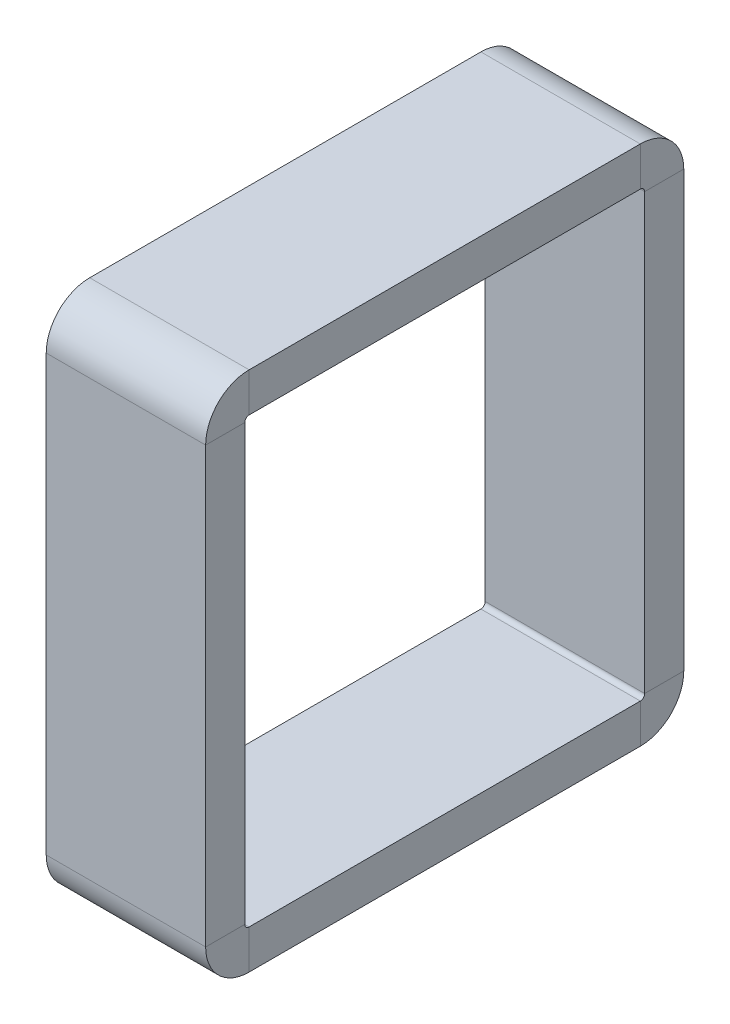
ISO-10303-21;
HEADER;
FILE_DESCRIPTION(('STEP AP214'),'2;1');
FILE_NAME('part.step','',(''),(''),'','','');
FILE_SCHEMA(('AUTOMOTIVE_DESIGN { 1 0 10303 214 1 1 1 1 }'));
ENDSEC;
DATA;
#1=APPLICATION_CONTEXT('core data for automotive mechanical design processes');
#2=APPLICATION_PROTOCOL_DEFINITION('international standard','automotive_design',2000,#1);
#3=PRODUCT_CONTEXT('',#1,'mechanical');
#4=PRODUCT('Part','Part','',(#3));
#5=PRODUCT_RELATED_PRODUCT_CATEGORY('part','',(#4));
#6=PRODUCT_DEFINITION_FORMATION('','',#4);
#7=PRODUCT_DEFINITION_CONTEXT('part definition',#1,'design');
#8=PRODUCT_DEFINITION('design','',#6,#7);
#9=PRODUCT_DEFINITION_SHAPE('','',#8);
#10=(LENGTH_UNIT() NAMED_UNIT(*) SI_UNIT(.MILLI.,.METRE.));
#11=(NAMED_UNIT(*) PLANE_ANGLE_UNIT() SI_UNIT($,.RADIAN.));
#12=(NAMED_UNIT(*) SI_UNIT($,.STERADIAN.) SOLID_ANGLE_UNIT());
#13=UNCERTAINTY_MEASURE_WITH_UNIT(LENGTH_MEASURE(1.E-05),#10,'distance_accuracy_value','');
#14=(GEOMETRIC_REPRESENTATION_CONTEXT(3) GLOBAL_UNCERTAINTY_ASSIGNED_CONTEXT((#13)) GLOBAL_UNIT_ASSIGNED_CONTEXT((#10,
#11,#12)) REPRESENTATION_CONTEXT('',''));
#15=CARTESIAN_POINT('',(0.,0.,0.));
#16=DIRECTION('',(0.,0.,1.));
#17=DIRECTION('',(1.,0.,0.));
#18=AXIS2_PLACEMENT_3D('',#15,#16,#17);
#19=CARTESIAN_POINT('',(-3.71677795736337,-0.75499913114187,-3.24612145499093));
#20=DIRECTION('',(1.,-1.74845553146952E-07,0.));
#21=DIRECTION('',(0.,-8.74227765734758E-08,-1.));
#22=AXIS2_PLACEMENT_3D('',#19,#20,#21);
#23=PLANE('',#22);
#24=CARTESIAN_POINT('',(-3.71677795648915,-0.74999913157898,-3.25112145542804));
#25=DIRECTION('',(-0.999999999999985,1.74845553146949E-07,0.));
#26=DIRECTION('',(1.74845553146949E-07,0.999999999999981,-8.74265104755874E-08));
#27=AXIS2_PLACEMENT_3D('',#24,#25,#26);
#28=CIRCLE('',#27,0.00999999999999571);
#29=CARTESIAN_POINT('',(-3.71677795474069,-0.739999131578984,-3.25112145630227));
#30=VERTEX_POINT('',#29);
#31=CARTESIAN_POINT('',(-3.71677795648915,-0.749999132454212,-3.26112145542804));
#32=VERTEX_POINT('',#31);
#33=EDGE_CURVE('E11',#30,#32,#28,.T.);
#34=ORIENTED_EDGE('',*,*,#33,.F.);
#35=DIRECTION('',(-1.74845555319994E-07,-0.999999999999981,8.74227702585101E-08));
#36=VECTOR('',#35,1.);
#37=CARTESIAN_POINT('',(-3.71677793900459,-0.649999131579984,-3.25112146417132));
#38=LINE('',#37,#36);
#39=CARTESIAN_POINT('',(-3.71677793900459,-0.649999131579984,-3.25112146417032));
#40=VERTEX_POINT('',#39);
#41=EDGE_CURVE('E295',#40,#30,#38,.T.);
#42=ORIENTED_EDGE('',*,*,#41,.F.);
#43=CARTESIAN_POINT('',(-3.71677795648915,-0.749999131579652,-3.25112145542837));
#44=DIRECTION('',(0.999999999999985,-1.74845553146949E-07,0.));
#45=DIRECTION('',(0.,-8.74165517753127E-08,-0.999999999999996));
#46=AXIS2_PLACEMENT_3D('',#43,#44,#45);
#47=CIRCLE('',#46,0.0999999999996649);
#48=CARTESIAN_POINT('',(-3.71677795648915,-0.749999140322262,-3.35112145542804));
#49=VERTEX_POINT('',#48);
#50=EDGE_CURVE('E292',#49,#40,#47,.T.);
#51=ORIENTED_EDGE('',*,*,#50,.F.);
#52=DIRECTION('',(0.,-8.74227727247025E-08,-0.999999999999996));
#53=VECTOR('',#52,1.);
#54=CARTESIAN_POINT('',(-3.71677795648915,-0.749999132453212,-3.26112145542804));
#55=LINE('',#54,#53);
#56=EDGE_CURVE('E281',#32,#49,#55,.T.);
#57=ORIENTED_EDGE('',*,*,#56,.F.);
#58=EDGE_LOOP('',(#34,#42,#51,#57));
#59=FACE_BOUND('',#58,.T.);
#60=ADVANCED_FACE('F17',(#59),#23,.F.);
#61=CARTESIAN_POINT('',(-3.35000013200837,-0.754999195271342,-3.24612145499092));
#62=DIRECTION('',(1.,-1.74845553146952E-07,0.));
#63=DIRECTION('',(0.,-8.74227765734758E-08,-1.));
#64=AXIS2_PLACEMENT_3D('',#61,#62,#63);
#65=PLANE('',#64);
#66=DIRECTION('',(0.,-8.74227764254459E-08,-0.999999999999996));
#67=VECTOR('',#66,1.);
#68=CARTESIAN_POINT('',(-3.35000013113415,-0.749999196582683,-3.26112145542804));
#69=LINE('',#68,#67);
#70=CARTESIAN_POINT('',(-3.35000013113415,-0.749999196583683,-3.26112145542804));
#71=VERTEX_POINT('',#70);
#72=CARTESIAN_POINT('',(-3.35000013113415,-0.749999204451733,-3.35112145542804));
#73=VERTEX_POINT('',#72);
#74=EDGE_CURVE('E24',#71,#73,#69,.T.);
#75=ORIENTED_EDGE('',*,*,#74,.T.);
#76=CARTESIAN_POINT('',(-3.35000013113415,-0.749999195709119,-3.25112145542837));
#77=DIRECTION('',(0.999999999999985,-1.74845553146949E-07,0.));
#78=DIRECTION('',(0.,-8.74161421030166E-08,-0.999999999999996));
#79=AXIS2_PLACEMENT_3D('',#76,#77,#78);
#80=CIRCLE('',#79,0.0999999999996649);
#81=CARTESIAN_POINT('',(-3.35000011364959,-0.649999195708455,-3.25112146417031));
#82=VERTEX_POINT('',#81);
#83=EDGE_CURVE('E290',#73,#82,#80,.T.);
#84=ORIENTED_EDGE('',*,*,#83,.T.);
#85=DIRECTION('',(1.74845555319994E-07,0.999999999999981,-8.74227702585101E-08));
#86=VECTOR('',#85,1.);
#87=CARTESIAN_POINT('',(-3.35000012938569,-0.739999195708455,-3.25112145630326));
#88=LINE('',#87,#86);
#89=CARTESIAN_POINT('',(-3.35000012938569,-0.739999195708455,-3.25112145630226));
#90=VERTEX_POINT('',#89);
#91=EDGE_CURVE('E284',#90,#82,#88,.T.);
#92=ORIENTED_EDGE('',*,*,#91,.F.);
#93=CARTESIAN_POINT('',(-3.35000013113415,-0.749999195708407,-3.25112145542809));
#94=DIRECTION('',(-0.999999999999985,1.74845553146949E-07,0.));
#95=DIRECTION('',(1.74845553146949E-07,0.999999999999981,-8.74179395538373E-08));
#96=AXIS2_PLACEMENT_3D('',#93,#94,#95);
#97=CIRCLE('',#96,0.00999999999999571);
#98=EDGE_CURVE('E274',#90,#71,#97,.T.);
#99=ORIENTED_EDGE('',*,*,#98,.T.);
#100=EDGE_LOOP('',(#75,#84,#92,#99));
#101=FACE_BOUND('',#100,.T.);
#102=ADVANCED_FACE('F409',(#101),#65,.T.);
#103=CARTESIAN_POINT('',(-3.71677795648914,-0.749999131579652,-3.25112145542837));
#104=DIRECTION('',(1.,-1.74845540855598E-07,0.));
#105=DIRECTION('',(-1.74845540855597E-07,-1.,8.74227765734759E-08));
#106=AXIS2_PLACEMENT_3D('',#103,#104,#105);
#107=CYLINDRICAL_SURFACE('',#106,0.0999999999996679);
#108=ORIENTED_EDGE('',*,*,#50,.T.);
#109=DIRECTION('',(-0.999999999999985,1.74845553083486E-07,0.));
#110=VECTOR('',#109,1.);
#111=CARTESIAN_POINT('',(-3.35000011364959,-0.649999195709456,-3.25112146417131));
#112=LINE('',#111,#110);
#113=EDGE_CURVE('E287',#82,#40,#112,.T.);
#114=ORIENTED_EDGE('',*,*,#113,.F.);
#115=ORIENTED_EDGE('',*,*,#83,.F.);
#116=DIRECTION('',(0.999999999999985,-1.74845553083486E-07,0.));
#117=VECTOR('',#116,1.);
#118=CARTESIAN_POINT('',(-3.71677795648915,-0.749999140321261,-3.35112145542804));
#119=LINE('',#118,#117);
#120=EDGE_CURVE('E268',#49,#73,#119,.T.);
#121=ORIENTED_EDGE('',*,*,#120,.F.);
#122=EDGE_LOOP('',(#108,#114,#115,#121));
#123=FACE_BOUND('',#122,.T.);
#124=ADVANCED_FACE('F345',(#123),#107,.T.);
#125=CARTESIAN_POINT('',(-3.71677795648914,-0.74999913157898,-3.25112145542804));
#126=DIRECTION('',(-1.,1.74845430233419E-07,1.1527081280392E-13));
#127=DIRECTION('',(-1.74845430233408E-07,-1.,8.74227765734759E-08));
#128=AXIS2_PLACEMENT_3D('',#125,#126,#127);
#129=CYLINDRICAL_SURFACE('',#128,0.00999999999999601);
#130=ORIENTED_EDGE('',*,*,#33,.T.);
#131=DIRECTION('',(0.999999999999985,-1.74844189739206E-07,0.));
#132=VECTOR('',#131,1.);
#133=CARTESIAN_POINT('',(-3.71677795648915,-0.749999132453461,-3.26112145542804));
#134=LINE('',#133,#132);
#135=EDGE_CURVE('E276',#32,#71,#134,.T.);
#136=ORIENTED_EDGE('',*,*,#135,.T.);
#137=ORIENTED_EDGE('',*,*,#98,.F.);
#138=DIRECTION('',(0.999999999999985,-1.74845553083486E-07,0.));
#139=VECTOR('',#138,1.);
#140=CARTESIAN_POINT('',(-3.71677795474069,-0.739999131578984,-3.25112145630327));
#141=LINE('',#140,#139);
#142=EDGE_CURVE('E262',#30,#90,#141,.T.);
#143=ORIENTED_EDGE('',*,*,#142,.F.);
#144=EDGE_LOOP('',(#130,#136,#137,#143));
#145=FACE_BOUND('',#144,.T.);
#146=ADVANCED_FACE('F304',(#145),#129,.F.);
#147=CARTESIAN_POINT('',(-3.71677793900458,-0.649999052899485,-2.35112146417132));
#148=DIRECTION('',(1.,-1.74845553146952E-07,0.));
#149=DIRECTION('',(-1.74845553146952E-07,-1.,8.74227765734759E-08));
#150=AXIS2_PLACEMENT_3D('',#147,#148,#149);
#151=PLANE('',#150);
#152=DIRECTION('',(0.,-8.7422776548804E-08,-0.999999999999996));
#153=VECTOR('',#152,1.);
#154=CARTESIAN_POINT('',(-3.71677793900458,-0.649999052899485,-2.35112146417132));
#155=LINE('',#154,#153);
#156=CARTESIAN_POINT('',(-3.71677793900358,-0.649999052902485,-2.35112146416832));
#157=VERTEX_POINT('',#156);
#158=EDGE_CURVE('E278',#157,#40,#155,.T.);
#159=ORIENTED_EDGE('',*,*,#158,.T.);
#160=ORIENTED_EDGE('',*,*,#41,.T.);
#161=DIRECTION('',(0.,-8.74227765488039E-08,-0.999999999999996));
#162=VECTOR('',#161,1.);
#163=CARTESIAN_POINT('',(-3.71677795474068,-0.739999052898485,-2.35112145630327));
#164=LINE('',#163,#162);
#165=CARTESIAN_POINT('',(-3.71677795473968,-0.739999052901485,-2.35112145630027));
#166=VERTEX_POINT('',#165);
#167=EDGE_CURVE('E265',#166,#30,#164,.T.);
#168=ORIENTED_EDGE('',*,*,#167,.F.);
#169=DIRECTION('',(-1.74845550387524E-07,-0.999999999999981,8.74333839915533E-08));
#170=VECTOR('',#169,1.);
#171=CARTESIAN_POINT('',(-3.71677793900358,-0.64999905290044,-2.35112146417227));
#172=LINE('',#171,#170);
#173=EDGE_CURVE('E147',#157,#166,#172,.T.);
#174=ORIENTED_EDGE('',*,*,#173,.F.);
#175=EDGE_LOOP('',(#159,#160,#168,#174));
#176=FACE_BOUND('',#175,.T.);
#177=ADVANCED_FACE('F297',(#176),#151,.F.);
#178=CARTESIAN_POINT('',(-3.35000011364958,-0.649999117028957,-2.35112146417131));
#179=DIRECTION('',(-1.74845553146952E-07,-1.,8.74227765734759E-08));
#180=DIRECTION('',(-1.,1.74845553146952E-07,0.));
#181=AXIS2_PLACEMENT_3D('',#178,#179,#180);
#182=PLANE('',#181);
#183=DIRECTION('',(0.,-8.7422776548804E-08,-0.999999999999996));
#184=VECTOR('',#183,1.);
#185=CARTESIAN_POINT('',(-3.35000011364958,-0.649999117028957,-2.35112146417131));
#186=LINE('',#185,#184);
#187=CARTESIAN_POINT('',(-3.35000011365058,-0.649999117031957,-2.35112146416831));
#188=VERTEX_POINT('',#187);
#189=EDGE_CURVE('E271',#188,#82,#186,.T.);
#190=ORIENTED_EDGE('',*,*,#189,.T.);
#191=ORIENTED_EDGE('',*,*,#113,.T.);
#192=ORIENTED_EDGE('',*,*,#158,.F.);
#193=DIRECTION('',(-0.999999999999985,1.74845553083486E-07,0.));
#194=VECTOR('',#193,1.);
#195=CARTESIAN_POINT('',(-3.35000011364958,-0.649999117028957,-2.35112146417131));
#196=LINE('',#195,#194);
#197=EDGE_CURVE('E255',#188,#157,#196,.T.);
#198=ORIENTED_EDGE('',*,*,#197,.F.);
#199=EDGE_LOOP('',(#190,#191,#192,#198));
#200=FACE_BOUND('',#199,.T.);
#201=ADVANCED_FACE('F342',(#200),#182,.F.);
#202=CARTESIAN_POINT('',(-3.71677795474068,-0.739999052898485,-2.35112145630327));
#203=DIRECTION('',(1.74845553146952E-07,1.,-8.74227765734759E-08));
#204=DIRECTION('',(1.,-1.74845553146952E-07,0.));
#205=AXIS2_PLACEMENT_3D('',#202,#203,#204);
#206=PLANE('',#205);
#207=ORIENTED_EDGE('',*,*,#167,.T.);
#208=ORIENTED_EDGE('',*,*,#142,.T.);
#209=DIRECTION('',(0.,-8.74227765488039E-08,-0.999999999999996));
#210=VECTOR('',#209,1.);
#211=CARTESIAN_POINT('',(-3.35000012938568,-0.739999117027957,-2.35112145630326));
#212=LINE('',#211,#210);
#213=CARTESIAN_POINT('',(-3.35000012938668,-0.739999117030957,-2.35112145630026));
#214=VERTEX_POINT('',#213);
#215=EDGE_CURVE('E259',#214,#90,#212,.T.);
#216=ORIENTED_EDGE('',*,*,#215,.F.);
#217=DIRECTION('',(0.999999999999985,-1.74845553083486E-07,0.));
#218=VECTOR('',#217,1.);
#219=CARTESIAN_POINT('',(-3.71677795474068,-0.739999052898485,-2.35112145630327));
#220=LINE('',#219,#218);
#221=EDGE_CURVE('E251',#166,#214,#220,.T.);
#222=ORIENTED_EDGE('',*,*,#221,.F.);
#223=EDGE_LOOP('',(#207,#208,#216,#222));
#224=FACE_BOUND('',#223,.T.);
#225=ADVANCED_FACE('F301',(#224),#206,.F.);
#226=CARTESIAN_POINT('',(-3.35000012938568,-0.739999117027957,-2.35112145630326));
#227=DIRECTION('',(-1.,1.74845553146952E-07,0.));
#228=DIRECTION('',(1.74845553146952E-07,1.,-8.74227765734759E-08));
#229=AXIS2_PLACEMENT_3D('',#226,#227,#228);
#230=PLANE('',#229);
#231=ORIENTED_EDGE('',*,*,#215,.T.);
#232=ORIENTED_EDGE('',*,*,#91,.T.);
#233=ORIENTED_EDGE('',*,*,#189,.F.);
#234=DIRECTION('',(1.7484555038515E-07,0.999999999999981,-8.74223508406634E-08));
#235=VECTOR('',#234,1.);
#236=CARTESIAN_POINT('',(-3.35000012938668,-0.739999117028224,-2.3511214563033));
#237=LINE('',#236,#235);
#238=EDGE_CURVE('E242',#214,#188,#237,.T.);
#239=ORIENTED_EDGE('',*,*,#238,.F.);
#240=EDGE_LOOP('',(#231,#232,#233,#239));
#241=FACE_BOUND('',#240,.T.);
#242=ADVANCED_FACE('F308',(#241),#230,.F.);
#243=CARTESIAN_POINT('',(-3.71677814007698,-1.7999991446924,-3.40112136363512));
#244=DIRECTION('',(-1.,1.74845553146952E-07,0.));
#245=DIRECTION('',(0.,8.74227765734759E-08,1.));
#246=AXIS2_PLACEMENT_3D('',#243,#244,#245);
#247=PLANE('',#246);
#248=ORIENTED_EDGE('',*,*,#56,.T.);
#249=DIRECTION('',(-1.74845553146948E-07,-0.999999999999981,8.7420776395673E-08));
#250=VECTOR('',#249,1.);
#251=CARTESIAN_POINT('',(-3.71677795648915,-0.749999140321262,-3.35112145542804));
#252=LINE('',#251,#250);
#253=CARTESIAN_POINT('',(-3.7167781313347,-1.74999914032026,-3.35112136800626));
#254=VERTEX_POINT('',#253);
#255=EDGE_CURVE('E253',#49,#254,#252,.T.);
#256=ORIENTED_EDGE('',*,*,#255,.T.);
#257=DIRECTION('',(0.,8.74116680263222E-08,0.999999999999996));
#258=VECTOR('',#257,1.);
#259=CARTESIAN_POINT('',(-3.7167781313347,-1.74999914032126,-3.35112136800726));
#260=LINE('',#259,#258);
#261=CARTESIAN_POINT('',(-3.7167781313337,-1.74999913245321,-3.26112136800626));
#262=VERTEX_POINT('',#261);
#263=EDGE_CURVE('E245',#254,#262,#260,.T.);
#264=ORIENTED_EDGE('',*,*,#263,.T.);
#265=DIRECTION('',(1.74845553146774E-07,0.999999999999981,-8.74217769285754E-08));
#266=VECTOR('',#265,1.);
#267=CARTESIAN_POINT('',(-3.7167781313347,-1.74999913245421,-3.26112136800626));
#268=LINE('',#267,#266);
#269=EDGE_CURVE('E233',#262,#32,#268,.T.);
#270=ORIENTED_EDGE('',*,*,#269,.T.);
#271=EDGE_LOOP('',(#248,#256,#264,#270));
#272=FACE_BOUND('',#271,.T.);
#273=ADVANCED_FACE('F350',(#272),#247,.T.);
#274=CARTESIAN_POINT('',(-3.71677795648915,-0.749999140321261,-3.35112145542804));
#275=DIRECTION('',(0.,8.74207763956747E-08,1.));
#276=DIRECTION('',(-1.74845553146952E-07,-1.,8.74207763956747E-08));
#277=AXIS2_PLACEMENT_3D('',#274,#275,#276);
#278=PLANE('',#277);
#279=ORIENTED_EDGE('',*,*,#120,.T.);
#280=DIRECTION('',(-1.74845553146948E-07,-0.999999999999981,8.7420776395673E-08));
#281=VECTOR('',#280,1.);
#282=CARTESIAN_POINT('',(-3.35000013113415,-0.749999204450733,-3.35112145542804));
#283=LINE('',#282,#281);
#284=CARTESIAN_POINT('',(-3.3500003059807,-1.74999920444973,-3.35112136800626));
#285=VERTEX_POINT('',#284);
#286=EDGE_CURVE('E247',#73,#285,#283,.T.);
#287=ORIENTED_EDGE('',*,*,#286,.T.);
#288=DIRECTION('',(0.999999999999985,-1.74845553083486E-07,0.));
#289=VECTOR('',#288,1.);
#290=CARTESIAN_POINT('',(-3.7167781313347,-1.74999914032126,-3.35112136800726));
#291=LINE('',#290,#289);
#292=EDGE_CURVE('E236',#254,#285,#291,.T.);
#293=ORIENTED_EDGE('',*,*,#292,.F.);
#294=ORIENTED_EDGE('',*,*,#255,.F.);
#295=EDGE_LOOP('',(#279,#287,#293,#294));
#296=FACE_BOUND('',#295,.T.);
#297=ADVANCED_FACE('F364',(#296),#278,.F.);
#298=CARTESIAN_POINT('',(-3.7167781313347,-1.74999913245421,-3.26112136800626));
#299=DIRECTION('',(0.,-8.74217769286645E-08,-1.));
#300=DIRECTION('',(1.74845553146952E-07,1.,-8.74217769286645E-08));
#301=AXIS2_PLACEMENT_3D('',#298,#299,#300);
#302=PLANE('',#301);
#303=DIRECTION('',(0.999999999999985,-1.74844189739206E-07,0.));
#304=VECTOR('',#303,1.);
#305=CARTESIAN_POINT('',(-3.7167781313347,-1.74999913245396,-3.26112136800626));
#306=LINE('',#305,#304);
#307=CARTESIAN_POINT('',(-3.3500003059807,-1.74999919658168,-3.26112136800626));
#308=VERTEX_POINT('',#307);
#309=EDGE_CURVE('E249',#262,#308,#306,.T.);
#310=ORIENTED_EDGE('',*,*,#309,.T.);
#311=DIRECTION('',(1.74845553146861E-07,0.999999999999981,-8.74217769286191E-08));
#312=VECTOR('',#311,1.);
#313=CARTESIAN_POINT('',(-3.3500003059797,-1.74999919658293,-3.26112136800626));
#314=LINE('',#313,#312);
#315=EDGE_CURVE('E239',#308,#71,#314,.T.);
#316=ORIENTED_EDGE('',*,*,#315,.T.);
#317=ORIENTED_EDGE('',*,*,#135,.F.);
#318=ORIENTED_EDGE('',*,*,#269,.F.);
#319=EDGE_LOOP('',(#310,#316,#317,#318));
#320=FACE_BOUND('',#319,.T.);
#321=ADVANCED_FACE('F355',(#320),#302,.F.);
#322=CARTESIAN_POINT('',(-3.35000031472198,-1.79999920882187,-3.40112136363512));
#323=DIRECTION('',(-1.,1.74845553146952E-07,0.));
#324=DIRECTION('',(0.,8.74227765734759E-08,1.));
#325=AXIS2_PLACEMENT_3D('',#322,#323,#324);
#326=PLANE('',#325);
#327=ORIENTED_EDGE('',*,*,#315,.F.);
#328=DIRECTION('',(0.,8.74121639268677E-08,0.999999999999996));
#329=VECTOR('',#328,1.);
#330=CARTESIAN_POINT('',(-3.3500003059797,-1.74999920444978,-3.3511213680063));
#331=LINE('',#330,#329);
#332=EDGE_CURVE('E228',#285,#308,#331,.T.);
#333=ORIENTED_EDGE('',*,*,#332,.F.);
#334=ORIENTED_EDGE('',*,*,#286,.F.);
#335=ORIENTED_EDGE('',*,*,#74,.F.);
#336=EDGE_LOOP('',(#327,#333,#334,#335));
#337=FACE_BOUND('',#336,.T.);
#338=ADVANCED_FACE('F361',(#337),#326,.F.);
#339=CARTESIAN_POINT('',(-3.71677814969348,-1.85499913114087,-3.24612135882787));
#340=DIRECTION('',(1.,-1.74845553146952E-07,0.));
#341=DIRECTION('',(0.,-8.74227765734759E-08,-1.));
#342=AXIS2_PLACEMENT_3D('',#339,#340,#341);
#343=PLANE('',#342);
#344=CARTESIAN_POINT('',(-3.7167781313347,-1.74999913157899,-3.25112136800627));
#345=DIRECTION('',(-0.999999999999985,1.74845553146949E-07,0.));
#346=DIRECTION('',(0.,-8.7420604089077E-08,-0.999999999999996));
#347=AXIS2_PLACEMENT_3D('',#344,#345,#346);
#348=CIRCLE('',#347,0.0099999999999977);
#349=CARTESIAN_POINT('',(-3.71677813308215,-1.75999913157898,-3.25112136713204));
#350=VERTEX_POINT('',#349);
#351=EDGE_CURVE('E231',#262,#350,#348,.T.);
#352=ORIENTED_EDGE('',*,*,#351,.F.);
#353=ORIENTED_EDGE('',*,*,#263,.F.);
#354=CARTESIAN_POINT('',(-3.7167781313347,-1.74999913157919,-3.25112136800747));
#355=DIRECTION('',(0.999999999999985,-1.74845553146949E-07,0.));
#356=DIRECTION('',(-1.74845553146949E-07,-0.999999999999981,8.74250316595358E-08));
#357=AXIS2_PLACEMENT_3D('',#354,#355,#356);
#358=CIRCLE('',#357,0.099999999998794);
#359=CARTESIAN_POINT('',(-3.71677814881825,-1.84999913157798,-3.25112135926399));
#360=VERTEX_POINT('',#359);
#361=EDGE_CURVE('E225',#360,#254,#358,.T.);
#362=ORIENTED_EDGE('',*,*,#361,.F.);
#363=DIRECTION('',(-1.74845555319994E-07,-0.999999999999981,8.74116680282638E-08));
#364=VECTOR('',#363,1.);
#365=CARTESIAN_POINT('',(-3.71677813308315,-1.75999913157898,-3.25112136713204));
#366=LINE('',#365,#364);
#367=EDGE_CURVE('E215',#350,#360,#366,.T.);
#368=ORIENTED_EDGE('',*,*,#367,.F.);
#369=EDGE_LOOP('',(#352,#353,#362,#368));
#370=FACE_BOUND('',#369,.T.);
#371=ADVANCED_FACE('F372',(#370),#343,.F.);
#372=CARTESIAN_POINT('',(-3.7167781313347,-1.74999913157919,-3.25112136800747));
#373=DIRECTION('',(1.,-1.74845565438307E-07,0.));
#374=DIRECTION('',(-1.74845565438306E-07,-1.,8.74227765734759E-08));
#375=AXIS2_PLACEMENT_3D('',#372,#373,#374);
#376=CYLINDRICAL_SURFACE('',#375,0.0999999999987971);
#377=ORIENTED_EDGE('',*,*,#361,.T.);
#378=ORIENTED_EDGE('',*,*,#292,.T.);
#379=CARTESIAN_POINT('',(-3.3500003059797,-1.74999919570866,-3.25112136800747));
#380=DIRECTION('',(0.999999999999985,-1.74845553146949E-07,0.));
#381=DIRECTION('',(-1.74845553146949E-07,-0.999999999999981,8.7425084950241E-08));
#382=AXIS2_PLACEMENT_3D('',#379,#380,#381);
#383=CIRCLE('',#382,0.099999999998794);
#384=CARTESIAN_POINT('',(-3.35000032346525,-1.84999919570746,-3.25112135926398));
#385=VERTEX_POINT('',#384);
#386=EDGE_CURVE('E218',#385,#285,#383,.T.);
#387=ORIENTED_EDGE('',*,*,#386,.F.);
#388=DIRECTION('',(0.999999999999985,-1.74845553083486E-07,0.));
#389=VECTOR('',#388,1.);
#390=CARTESIAN_POINT('',(-3.71677814881925,-1.84999913157798,-3.25112135926499));
#391=LINE('',#390,#389);
#392=EDGE_CURVE('E209',#360,#385,#391,.T.);
#393=ORIENTED_EDGE('',*,*,#392,.F.);
#394=EDGE_LOOP('',(#377,#378,#387,#393));
#395=FACE_BOUND('',#394,.T.);
#396=ADVANCED_FACE('F368',(#395),#376,.T.);
#397=CARTESIAN_POINT('',(-3.7167781313347,-1.74999913157899,-3.25112136800627));
#398=DIRECTION('',(-1.,1.74845676060506E-07,1.15270791313044E-13));
#399=DIRECTION('',(-1.74845676060496E-07,-1.,8.74227765734759E-08));
#400=AXIS2_PLACEMENT_3D('',#397,#398,#399);
#401=CYLINDRICAL_SURFACE('',#400,0.00999999999999801);
#402=ORIENTED_EDGE('',*,*,#351,.T.);
#403=DIRECTION('',(0.999999999999985,-1.74842826394926E-07,0.));
#404=VECTOR('',#403,1.);
#405=CARTESIAN_POINT('',(-3.71677813308315,-1.75999913157898,-3.25112136713204));
#406=LINE('',#405,#404);
#407=CARTESIAN_POINT('',(-3.35000030772915,-1.75999919570746,-3.25112136713203));
#408=VERTEX_POINT('',#407);
#409=EDGE_CURVE('E221',#350,#408,#406,.T.);
#410=ORIENTED_EDGE('',*,*,#409,.T.);
#411=CARTESIAN_POINT('',(-3.3500003059797,-1.7499991957085,-3.25112136800631));
#412=DIRECTION('',(-0.999999999999985,1.74845553146949E-07,0.));
#413=DIRECTION('',(0.,-8.73160876935426E-08,-0.999999999999996));
#414=AXIS2_PLACEMENT_3D('',#411,#412,#413);
#415=CIRCLE('',#414,0.0099999999999977);
#416=EDGE_CURVE('E212',#308,#408,#415,.T.);
#417=ORIENTED_EDGE('',*,*,#416,.F.);
#418=ORIENTED_EDGE('',*,*,#309,.F.);
#419=EDGE_LOOP('',(#402,#410,#417,#418));
#420=FACE_BOUND('',#419,.T.);
#421=ADVANCED_FACE('F374',(#420),#401,.F.);
#422=CARTESIAN_POINT('',(-3.35000032433848,-1.85499919527034,-3.24612135882787));
#423=DIRECTION('',(1.,-1.74845553146952E-07,0.));
#424=DIRECTION('',(0.,-8.74227765734759E-08,-1.));
#425=AXIS2_PLACEMENT_3D('',#422,#423,#424);
#426=PLANE('',#425);
#427=DIRECTION('',(-1.74845550383717E-07,-0.999999999999981,8.74106564907539E-08));
#428=VECTOR('',#427,1.);
#429=CARTESIAN_POINT('',(-3.35000030772815,-1.75999919570745,-3.25112136713194));
#430=LINE('',#429,#428);
#431=EDGE_CURVE('E223',#408,#385,#430,.T.);
#432=ORIENTED_EDGE('',*,*,#431,.T.);
#433=ORIENTED_EDGE('',*,*,#386,.T.);
#434=ORIENTED_EDGE('',*,*,#332,.T.);
#435=ORIENTED_EDGE('',*,*,#416,.T.);
#436=EDGE_LOOP('',(#432,#433,#434,#435));
#437=FACE_BOUND('',#436,.T.);
#438=ADVANCED_FACE('F377',(#437),#426,.T.);
#439=CARTESIAN_POINT('',(-3.7167781566873,-1.89499913551501,-3.29612135533096));
#440=DIRECTION('',(-1.,1.74845553146952E-07,0.));
#441=DIRECTION('',(0.,8.74227765734759E-08,1.));
#442=AXIS2_PLACEMENT_3D('',#439,#440,#441);
#443=PLANE('',#442);
#444=ORIENTED_EDGE('',*,*,#367,.T.);
#445=DIRECTION('',(0.,8.74194432892096E-08,0.999999999999996));
#446=VECTOR('',#445,1.);
#447=CARTESIAN_POINT('',(-3.71677814881925,-1.84999913157798,-3.25112135926499));
#448=LINE('',#447,#446);
#449=CARTESIAN_POINT('',(-3.71677814881825,-1.84999905290048,-2.35112135926599));
#450=VERTEX_POINT('',#449);
#451=EDGE_CURVE('E207',#360,#450,#448,.T.);
#452=ORIENTED_EDGE('',*,*,#451,.T.);
#453=DIRECTION('',(1.74845555318051E-07,0.999999999999981,-8.74227850605123E-08));
#454=VECTOR('',#453,1.);
#455=CARTESIAN_POINT('',(-3.71677814881925,-1.84999905290048,-2.35112135926499));
#456=LINE('',#455,#454);
#457=CARTESIAN_POINT('',(-3.71677813308215,-1.75999905290048,-2.35112136713304));
#458=VERTEX_POINT('',#457);
#459=EDGE_CURVE('E201',#450,#458,#456,.T.);
#460=ORIENTED_EDGE('',*,*,#459,.T.);
#461=DIRECTION('',(0.,-8.74205547459126E-08,-0.999999999999996));
#462=VECTOR('',#461,1.);
#463=CARTESIAN_POINT('',(-3.71677813308315,-1.75999905290048,-2.35112136713304));
#464=LINE('',#463,#462);
#465=EDGE_CURVE('E192',#458,#350,#464,.T.);
#466=ORIENTED_EDGE('',*,*,#465,.T.);
#467=EDGE_LOOP('',(#444,#452,#460,#466));
#468=FACE_BOUND('',#467,.T.);
#469=ADVANCED_FACE('F397',(#468),#443,.T.);
#470=CARTESIAN_POINT('',(-3.71677814881925,-1.84999913157798,-3.25112135926499));
#471=DIRECTION('',(1.74845553146952E-07,1.,-8.74194431905235E-08));
#472=DIRECTION('',(0.,8.74194431905235E-08,1.));
#473=AXIS2_PLACEMENT_3D('',#470,#471,#472);
#474=PLANE('',#473);
#475=ORIENTED_EDGE('',*,*,#392,.T.);
#476=DIRECTION('',(0.,8.74194432892097E-08,0.999999999999996));
#477=VECTOR('',#476,1.);
#478=CARTESIAN_POINT('',(-3.35000032346425,-1.84999919570746,-3.25112135926498));
#479=LINE('',#478,#477);
#480=CARTESIAN_POINT('',(-3.35000032346525,-1.84999911702996,-2.35112135926598));
#481=VERTEX_POINT('',#480);
#482=EDGE_CURVE('E203',#385,#481,#479,.T.);
#483=ORIENTED_EDGE('',*,*,#482,.T.);
#484=DIRECTION('',(0.999999999999985,-1.74845553083487E-07,0.));
#485=VECTOR('',#484,1.);
#486=CARTESIAN_POINT('',(-3.71677814881925,-1.84999905290048,-2.35112135926499));
#487=LINE('',#486,#485);
#488=EDGE_CURVE('E195',#450,#481,#487,.T.);
#489=ORIENTED_EDGE('',*,*,#488,.F.);
#490=ORIENTED_EDGE('',*,*,#451,.F.);
#491=EDGE_LOOP('',(#475,#483,#489,#490));
#492=FACE_BOUND('',#491,.T.);
#493=ADVANCED_FACE('F381',(#492),#474,.F.);
#494=CARTESIAN_POINT('',(-3.71677813308315,-1.75999905290048,-2.35112136713304));
#495=DIRECTION('',(-1.74842826458391E-07,-1.,8.7420554400413E-08));
#496=DIRECTION('',(0.,-8.7420554400413E-08,-1.));
#497=AXIS2_PLACEMENT_3D('',#494,#495,#496);
#498=PLANE('',#497);
#499=DIRECTION('',(0.999999999999985,-1.74842826394926E-07,0.));
#500=VECTOR('',#499,1.);
#501=CARTESIAN_POINT('',(-3.71677813308315,-1.75999905290048,-2.35112136713304));
#502=LINE('',#501,#500);
#503=CARTESIAN_POINT('',(-3.35000030772915,-1.75999911702996,-2.35112136713303));
#504=VERTEX_POINT('',#503);
#505=EDGE_CURVE('E205',#458,#504,#502,.T.);
#506=ORIENTED_EDGE('',*,*,#505,.T.);
#507=DIRECTION('',(0.,-8.74205544991963E-08,-0.999999999999996));
#508=VECTOR('',#507,1.);
#509=CARTESIAN_POINT('',(-3.35000030772815,-1.75999911702896,-2.35112136713303));
#510=LINE('',#509,#508);
#511=EDGE_CURVE('E198',#504,#408,#510,.T.);
#512=ORIENTED_EDGE('',*,*,#511,.T.);
#513=ORIENTED_EDGE('',*,*,#409,.F.);
#514=ORIENTED_EDGE('',*,*,#465,.F.);
#515=EDGE_LOOP('',(#506,#512,#513,#514));
#516=FACE_BOUND('',#515,.T.);
#517=ADVANCED_FACE('F398',(#516),#498,.F.);
#518=CARTESIAN_POINT('',(-3.35000033133231,-1.89499919964448,-3.29612135533096));
#519=DIRECTION('',(-1.,1.74845553146952E-07,0.));
#520=DIRECTION('',(0.,8.74227765734759E-08,1.));
#521=AXIS2_PLACEMENT_3D('',#518,#519,#520);
#522=PLANE('',#521);
#523=ORIENTED_EDGE('',*,*,#511,.F.);
#524=DIRECTION('',(1.74845550383726E-07,0.999999999999981,-8.74227751918632E-08));
#525=VECTOR('',#524,1.);
#526=CARTESIAN_POINT('',(-3.35000032346525,-1.84999911702996,-2.35112135926498));
#527=LINE('',#526,#525);
#528=EDGE_CURVE('E187',#481,#504,#527,.T.);
#529=ORIENTED_EDGE('',*,*,#528,.F.);
#530=ORIENTED_EDGE('',*,*,#482,.F.);
#531=ORIENTED_EDGE('',*,*,#431,.F.);
#532=EDGE_LOOP('',(#523,#529,#530,#531));
#533=FACE_BOUND('',#532,.T.);
#534=ADVANCED_FACE('F385',(#533),#522,.F.);
#535=CARTESIAN_POINT('',(-3.71677814969247,-1.85499904372109,-2.24612135882887));
#536=DIRECTION('',(1.,-1.74845553146952E-07,0.));
#537=DIRECTION('',(0.,-8.74227765734759E-08,-1.));
#538=AXIS2_PLACEMENT_3D('',#535,#536,#537);
#539=PLANE('',#538);
#540=CARTESIAN_POINT('',(-3.71677813133369,-1.74999905290049,-2.35112136800726));
#541=DIRECTION('',(-0.999999999999985,1.74845553146949E-07,0.));
#542=DIRECTION('',(-1.74845553146949E-07,-0.999999999999981,8.74226024905097E-08));
#543=AXIS2_PLACEMENT_3D('',#540,#541,#542);
#544=CIRCLE('',#543,0.00999999999999926);
#545=CARTESIAN_POINT('',(-3.71677813133369,-1.74999905202526,-2.34112136800726));
#546=VERTEX_POINT('',#545);
#547=EDGE_CURVE('E190',#458,#546,#544,.T.);
#548=ORIENTED_EDGE('',*,*,#547,.F.);
#549=ORIENTED_EDGE('',*,*,#459,.F.);
#550=CARTESIAN_POINT('',(-3.71677813133369,-1.74999905290051,-2.35112136800824));
#551=DIRECTION('',(0.999999999999985,-1.74845553146949E-07,0.));
#552=DIRECTION('',(0.,8.74230199343852E-08,0.999999999999996));
#553=AXIS2_PLACEMENT_3D('',#550,#551,#552);
#554=CIRCLE('',#553,0.0999999999999726);
#555=CARTESIAN_POINT('',(-3.71677813133369,-1.74999904415821,-2.25112136800826));
#556=VERTEX_POINT('',#555);
#557=EDGE_CURVE('E184',#556,#450,#554,.T.);
#558=ORIENTED_EDGE('',*,*,#557,.F.);
#559=DIRECTION('',(0.,8.74111622599545E-08,0.999999999999996));
#560=VECTOR('',#559,1.);
#561=CARTESIAN_POINT('',(-3.71677813133369,-1.74999905202621,-2.34112136800731));
#562=LINE('',#561,#560);
#563=EDGE_CURVE('E176',#546,#556,#562,.T.);
#564=ORIENTED_EDGE('',*,*,#563,.F.);
#565=EDGE_LOOP('',(#548,#549,#558,#564));
#566=FACE_BOUND('',#565,.T.);
#567=ADVANCED_FACE('F395',(#566),#539,.F.);
#568=CARTESIAN_POINT('',(-3.71677813133369,-1.74999905290051,-2.35112136800824));
#569=DIRECTION('',(1.,-1.74845565438305E-07,0.));
#570=DIRECTION('',(-1.74845565438306E-07,-1.,8.74227765734759E-08));
#571=AXIS2_PLACEMENT_3D('',#568,#569,#570);
#572=CYLINDRICAL_SURFACE('',#571,0.0999999999999757);
#573=ORIENTED_EDGE('',*,*,#557,.T.);
#574=ORIENTED_EDGE('',*,*,#488,.T.);
#575=CARTESIAN_POINT('',(-3.35000030598069,-1.74999911702999,-2.35112136800823));
#576=DIRECTION('',(0.999999999999985,-1.74845553146949E-07,0.));
#577=DIRECTION('',(0.,8.74230643433062E-08,0.999999999999996));
#578=AXIS2_PLACEMENT_3D('',#575,#576,#577);
#579=CIRCLE('',#578,0.0999999999999726);
#580=CARTESIAN_POINT('',(-3.35000030598069,-1.74999910828768,-2.25112136800826));
#581=VERTEX_POINT('',#580);
#582=EDGE_CURVE('E178',#581,#481,#579,.T.);
#583=ORIENTED_EDGE('',*,*,#582,.F.);
#584=DIRECTION('',(0.999999999999985,-1.7484418974016E-07,0.));
#585=VECTOR('',#584,1.);
#586=CARTESIAN_POINT('',(-3.71677813133369,-1.74999904415896,-2.25112136800826));
#587=LINE('',#586,#585);
#588=EDGE_CURVE('E167',#556,#581,#587,.T.);
#589=ORIENTED_EDGE('',*,*,#588,.F.);
#590=EDGE_LOOP('',(#573,#574,#583,#589));
#591=FACE_BOUND('',#590,.T.);
#592=ADVANCED_FACE('F335',(#591),#572,.T.);
#593=CARTESIAN_POINT('',(-3.71677813133369,-1.74999905290049,-2.35112136800726));
#594=DIRECTION('',(-1.,1.74845676060485E-07,-1.30556296525245E-13));
#595=DIRECTION('',(-1.74845676060496E-07,-1.,8.74227765734759E-08));
#596=AXIS2_PLACEMENT_3D('',#593,#594,#595);
#597=CYLINDRICAL_SURFACE('',#596,0.00999999999999957);
#598=ORIENTED_EDGE('',*,*,#547,.T.);
#599=DIRECTION('',(0.999999999999985,-1.7484555308444E-07,0.));
#600=VECTOR('',#599,1.);
#601=CARTESIAN_POINT('',(-3.71677813133369,-1.74999905202626,-2.34112136800726));
#602=LINE('',#601,#600);
#603=CARTESIAN_POINT('',(-3.35000030598069,-1.74999911615473,-2.34112136800726));
#604=VERTEX_POINT('',#603);
#605=EDGE_CURVE('E158',#546,#604,#602,.T.);
#606=ORIENTED_EDGE('',*,*,#605,.T.);
#607=CARTESIAN_POINT('',(-3.35000030598069,-1.74999911703,-2.35112136800721));
#608=DIRECTION('',(-0.999999999999985,1.74845553146949E-07,0.));
#609=DIRECTION('',(-1.74845553146949E-07,-0.999999999999981,8.74181171894902E-08));
#610=AXIS2_PLACEMENT_3D('',#607,#608,#609);
#611=CIRCLE('',#610,0.00999999999999926);
#612=EDGE_CURVE('E173',#504,#604,#611,.T.);
#613=ORIENTED_EDGE('',*,*,#612,.F.);
#614=ORIENTED_EDGE('',*,*,#505,.F.);
#615=EDGE_LOOP('',(#598,#606,#613,#614));
#616=FACE_BOUND('',#615,.T.);
#617=ADVANCED_FACE('F389',(#616),#597,.F.);
#618=CARTESIAN_POINT('',(-3.35000032433947,-1.85499910785057,-2.24612135882887));
#619=DIRECTION('',(1.,-1.74845553146952E-07,0.));
#620=DIRECTION('',(0.,-8.74227765734759E-08,-1.));
#621=AXIS2_PLACEMENT_3D('',#618,#619,#620);
#622=PLANE('',#621);
#623=DIRECTION('',(0.,8.74227776599981E-08,0.999999999999996));
#624=VECTOR('',#623,1.);
#625=CARTESIAN_POINT('',(-3.35000030598069,-1.74999911615573,-2.34112136800726));
#626=LINE('',#625,#624);
#627=EDGE_CURVE('E182',#604,#581,#626,.T.);
#628=ORIENTED_EDGE('',*,*,#627,.T.);
#629=ORIENTED_EDGE('',*,*,#582,.T.);
#630=ORIENTED_EDGE('',*,*,#528,.T.);
#631=ORIENTED_EDGE('',*,*,#612,.T.);
#632=EDGE_LOOP('',(#628,#629,#630,#631));
#633=FACE_BOUND('',#632,.T.);
#634=ADVANCED_FACE('F331',(#633),#622,.T.);
#635=CARTESIAN_POINT('',(-3.71677814007597,-1.7999990563984,-2.39112136363612));
#636=DIRECTION('',(-1.,1.74845553146952E-07,0.));
#637=DIRECTION('',(0.,8.74227765734759E-08,1.));
#638=AXIS2_PLACEMENT_3D('',#635,#636,#637);
#639=PLANE('',#638);
#640=ORIENTED_EDGE('',*,*,#563,.T.);
#641=DIRECTION('',(1.74845553146788E-07,0.999999999999981,-8.74187473519928E-08));
#642=VECTOR('',#641,1.);
#643=CARTESIAN_POINT('',(-3.71677813133369,-1.74999904415913,-2.25112136800829));
#644=LINE('',#643,#642);
#645=CARTESIAN_POINT('',(-3.71677795648814,-0.749999044159207,-2.25112145542704));
#646=VERTEX_POINT('',#645);
#647=EDGE_CURVE('E135',#556,#646,#644,.T.);
#648=ORIENTED_EDGE('',*,*,#647,.T.);
#649=DIRECTION('',(0.,-8.74231428002584E-08,-0.999999999999996));
#650=VECTOR('',#649,1.);
#651=CARTESIAN_POINT('',(-3.71677795648814,-0.749999044158174,-2.25112145542729));
#652=LINE('',#651,#650);
#653=CARTESIAN_POINT('',(-3.71677795648814,-0.749999052027257,-2.34112145542604));
#654=VERTEX_POINT('',#653);
#655=EDGE_CURVE('E127',#646,#654,#652,.T.);
#656=ORIENTED_EDGE('',*,*,#655,.T.);
#657=DIRECTION('',(-1.74845553146948E-07,-0.999999999999981,8.74188672561595E-08));
#658=VECTOR('',#657,1.);
#659=CARTESIAN_POINT('',(-3.71677795648814,-0.749999052026253,-2.34112145542613));
#660=LINE('',#659,#658);
#661=EDGE_CURVE('E132',#654,#546,#660,.T.);
#662=ORIENTED_EDGE('',*,*,#661,.T.);
#663=EDGE_LOOP('',(#640,#648,#656,#662));
#664=FACE_BOUND('',#663,.T.);
#665=ADVANCED_FACE('F130',(#664),#639,.T.);
#666=CARTESIAN_POINT('',(-3.71677813133369,-1.74999904415921,-2.25112136800826));
#667=DIRECTION('',(0.,-8.74187762178735E-08,-1.));
#668=DIRECTION('',(1.74845553146952E-07,1.,-8.74187762178735E-08));
#669=AXIS2_PLACEMENT_3D('',#666,#667,#668);
#670=PLANE('',#669);
#671=ORIENTED_EDGE('',*,*,#588,.T.);
#672=DIRECTION('',(1.74845553146861E-07,0.999999999999981,-8.74187762178281E-08));
#673=VECTOR('',#672,1.);
#674=CARTESIAN_POINT('',(-3.35000030598069,-1.74999910828793,-2.25112136800826));
#675=LINE('',#674,#673);
#676=CARTESIAN_POINT('',(-3.35000013113514,-0.749999108288679,-2.25112145542704));
#677=VERTEX_POINT('',#676);
#678=EDGE_CURVE('E139',#581,#677,#675,.T.);
#679=ORIENTED_EDGE('',*,*,#678,.T.);
#680=DIRECTION('',(0.999999999999985,-1.7484418974016E-07,0.));
#681=VECTOR('',#680,1.);
#682=CARTESIAN_POINT('',(-3.71677795648814,-0.749999044158457,-2.25112145542704));
#683=LINE('',#682,#681);
#684=EDGE_CURVE('E159',#646,#677,#683,.T.);
#685=ORIENTED_EDGE('',*,*,#684,.F.);
#686=ORIENTED_EDGE('',*,*,#647,.F.);
#687=EDGE_LOOP('',(#671,#679,#685,#686));
#688=FACE_BOUND('',#687,.T.);
#689=ADVANCED_FACE('F338',(#688),#670,.F.);
#690=CARTESIAN_POINT('',(-3.71677795648814,-0.749999052026257,-2.34112145542604));
#691=DIRECTION('',(0.,8.74187766619627E-08,1.));
#692=DIRECTION('',(-1.74845553146952E-07,-1.,8.74187766619627E-08));
#693=AXIS2_PLACEMENT_3D('',#690,#691,#692);
#694=PLANE('',#693);
#695=DIRECTION('',(0.999999999999985,-1.7484555308444E-07,0.));
#696=VECTOR('',#695,1.);
#697=CARTESIAN_POINT('',(-3.71677795648814,-0.749999052026257,-2.34112145542604));
#698=LINE('',#697,#696);
#699=CARTESIAN_POINT('',(-3.35000013113514,-0.749999116156729,-2.34112145542604));
#700=VERTEX_POINT('',#699);
#701=EDGE_CURVE('E156',#654,#700,#698,.T.);
#702=ORIENTED_EDGE('',*,*,#701,.T.);
#703=DIRECTION('',(-1.74845553146948E-07,-0.999999999999981,8.74187766619611E-08));
#704=VECTOR('',#703,1.);
#705=CARTESIAN_POINT('',(-3.35000013113514,-0.749999116155729,-2.34112145542604));
#706=LINE('',#705,#704);
#707=EDGE_CURVE('E140',#700,#604,#706,.T.);
#708=ORIENTED_EDGE('',*,*,#707,.T.);
#709=ORIENTED_EDGE('',*,*,#605,.F.);
#710=ORIENTED_EDGE('',*,*,#661,.F.);
#711=EDGE_LOOP('',(#702,#708,#709,#710));
#712=FACE_BOUND('',#711,.T.);
#713=ADVANCED_FACE('F154',(#712),#694,.F.);
#714=CARTESIAN_POINT('',(-3.35000031472297,-1.79999912052687,-2.39112136363612));
#715=DIRECTION('',(-1.,1.74845553146952E-07,0.));
#716=DIRECTION('',(0.,8.74227765734759E-08,1.));
#717=AXIS2_PLACEMENT_3D('',#714,#715,#716);
#718=PLANE('',#717);
#719=ORIENTED_EDGE('',*,*,#707,.F.);
#720=DIRECTION('',(0.,-8.74222718917757E-08,-0.999999999999996));
#721=VECTOR('',#720,1.);
#722=CARTESIAN_POINT('',(-3.35000013113514,-0.749999108287724,-2.25112145542708));
#723=LINE('',#722,#721);
#724=EDGE_CURVE('E151',#677,#700,#723,.T.);
#725=ORIENTED_EDGE('',*,*,#724,.F.);
#726=ORIENTED_EDGE('',*,*,#678,.F.);
#727=ORIENTED_EDGE('',*,*,#627,.F.);
#728=EDGE_LOOP('',(#719,#725,#726,#727));
#729=FACE_BOUND('',#728,.T.);
#730=ADVANCED_FACE('F328',(#729),#718,.F.);
#731=CARTESIAN_POINT('',(-3.71677795736237,-0.754999043722093,-2.24612145498893));
#732=DIRECTION('',(1.,-1.74845553146952E-07,0.));
#733=DIRECTION('',(0.,-8.74227765734759E-08,-1.));
#734=AXIS2_PLACEMENT_3D('',#731,#732,#733);
#735=PLANE('',#734);
#736=CARTESIAN_POINT('',(-3.71677795648814,-0.749999052901483,-2.35112145542604));
#737=DIRECTION('',(-0.999999999999985,1.74845553146949E-07,0.));
#738=DIRECTION('',(0.,8.74180727805808E-08,0.999999999999996));
#739=AXIS2_PLACEMENT_3D('',#736,#737,#738);
#740=CIRCLE('',#739,0.00999999999999815);
#741=EDGE_CURVE('E144',#654,#166,#740,.T.);
#742=ORIENTED_EDGE('',*,*,#741,.F.);
#743=ORIENTED_EDGE('',*,*,#655,.F.);
#744=CARTESIAN_POINT('',(-3.71677795648814,-0.749999052900589,-2.35112145542514));
#745=DIRECTION('',(0.999999999999985,-1.74845553146949E-07,0.));
#746=DIRECTION('',(1.74845553146949E-07,0.999999999999981,-8.74365158071088E-08));
#747=AXIS2_PLACEMENT_3D('',#744,#745,#746);
#748=CIRCLE('',#747,0.0999999999981009);
#749=EDGE_CURVE('E317',#157,#646,#748,.T.);
#750=ORIENTED_EDGE('',*,*,#749,.F.);
#751=ORIENTED_EDGE('',*,*,#173,.T.);
#752=EDGE_LOOP('',(#742,#743,#750,#751));
#753=FACE_BOUND('',#752,.T.);
#754=ADVANCED_FACE('F145',(#753),#735,.F.);
#755=CARTESIAN_POINT('',(-3.71677795648814,-0.749999052900589,-2.35112145542514));
#756=DIRECTION('',(1.,-1.74845540855596E-07,0.));
#757=DIRECTION('',(-1.74845540855597E-07,-1.,8.74227765734759E-08));
#758=AXIS2_PLACEMENT_3D('',#755,#756,#757);
#759=CYLINDRICAL_SURFACE('',#758,0.0999999999981039);
#760=ORIENTED_EDGE('',*,*,#749,.T.);
#761=ORIENTED_EDGE('',*,*,#684,.T.);
#762=CARTESIAN_POINT('',(-3.35000013113514,-0.749999117030056,-2.35112145542514));
#763=DIRECTION('',(0.999999999999985,-1.74845553146949E-07,0.));
#764=DIRECTION('',(1.74845553146949E-07,0.999999999999981,-8.74365602160298E-08));
#765=AXIS2_PLACEMENT_3D('',#762,#763,#764);
#766=CIRCLE('',#765,0.0999999999981009);
#767=EDGE_CURVE('E315',#188,#677,#766,.T.);
#768=ORIENTED_EDGE('',*,*,#767,.F.);
#769=ORIENTED_EDGE('',*,*,#197,.T.);
#770=EDGE_LOOP('',(#760,#761,#768,#769));
#771=FACE_BOUND('',#770,.T.);
#772=ADVANCED_FACE('F340',(#771),#759,.T.);
#773=CARTESIAN_POINT('',(-3.71677795648814,-0.749999052901483,-2.35112145542604));
#774=DIRECTION('',(-1.,1.74845430233397E-07,-1.30556275034377E-13));
#775=DIRECTION('',(-1.74845430233408E-07,-1.,8.74227765734759E-08));
#776=AXIS2_PLACEMENT_3D('',#773,#774,#775);
#777=CYLINDRICAL_SURFACE('',#776,0.00999999999999845);
#778=ORIENTED_EDGE('',*,*,#741,.T.);
#779=ORIENTED_EDGE('',*,*,#221,.T.);
#780=CARTESIAN_POINT('',(-3.35000013113514,-0.74999911703091,-2.35112145542599));
#781=DIRECTION('',(-0.999999999999985,1.74845553146949E-07,0.));
#782=DIRECTION('',(0.,8.74135541728667E-08,0.999999999999996));
#783=AXIS2_PLACEMENT_3D('',#780,#781,#782);
#784=CIRCLE('',#783,0.00999999999999815);
#785=EDGE_CURVE('E164',#700,#214,#784,.T.);
#786=ORIENTED_EDGE('',*,*,#785,.F.);
#787=ORIENTED_EDGE('',*,*,#701,.F.);
#788=EDGE_LOOP('',(#778,#779,#786,#787));
#789=FACE_BOUND('',#788,.T.);
#790=ADVANCED_FACE('F162',(#789),#777,.F.);
#791=CARTESIAN_POINT('',(-3.35000013200937,-0.754999107851565,-2.24612145498892));
#792=DIRECTION('',(1.,-1.74845553146952E-07,0.));
#793=DIRECTION('',(0.,-8.74227765734759E-08,-1.));
#794=AXIS2_PLACEMENT_3D('',#791,#792,#793);
#795=PLANE('',#794);
#796=ORIENTED_EDGE('',*,*,#238,.T.);
#797=ORIENTED_EDGE('',*,*,#767,.T.);
#798=ORIENTED_EDGE('',*,*,#724,.T.);
#799=ORIENTED_EDGE('',*,*,#785,.T.);
#800=EDGE_LOOP('',(#796,#797,#798,#799));
#801=FACE_BOUND('',#800,.T.);
#802=ADVANCED_FACE('F313',(#801),#795,.T.);
#803=CLOSED_SHELL('',(#60,#102,#124,#146,#177,#201,#225,#242,#273,#297,#321,#338,#371,#396,#421,
#438,#469,#493,#517,#534,#567,#592,#617,#634,#665,#689,#713,#730,#754,#772,#790,#802));
#804=MANIFOLD_SOLID_BREP('B1',#803);
#805=ADVANCED_BREP_SHAPE_REPRESENTATION('',(#18,#804),#14);
#806=SHAPE_DEFINITION_REPRESENTATION(#9,#805);
ENDSEC;
END-ISO-10303-21;
